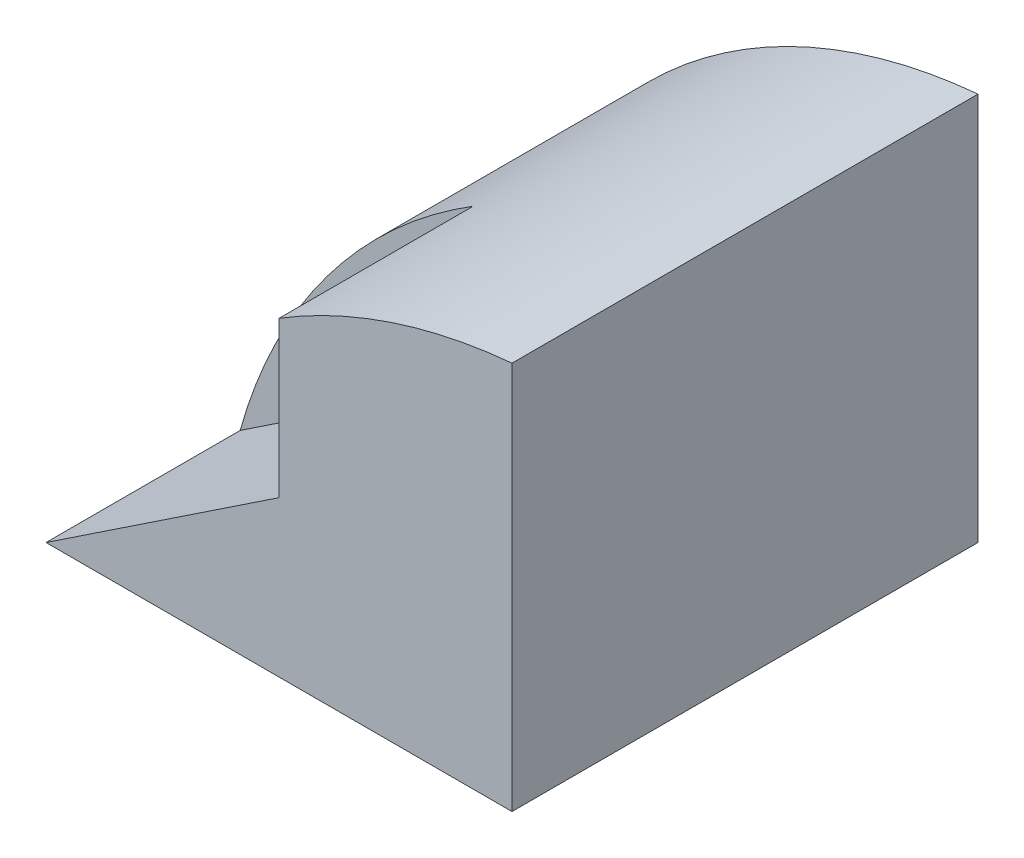
ISO-10303-21;
HEADER;
FILE_DESCRIPTION(('STEP AP214'),'2;1');
FILE_NAME('part.step','',(''),(''),'','','');
FILE_SCHEMA(('AUTOMOTIVE_DESIGN { 1 0 10303 214 1 1 1 1 }'));
ENDSEC;
DATA;
#1=APPLICATION_CONTEXT('core data for automotive mechanical design processes');
#2=APPLICATION_PROTOCOL_DEFINITION('international standard','automotive_design',2000,#1);
#3=PRODUCT_CONTEXT('',#1,'mechanical');
#4=PRODUCT('Part','Part','',(#3));
#5=PRODUCT_RELATED_PRODUCT_CATEGORY('part','',(#4));
#6=PRODUCT_DEFINITION_FORMATION('','',#4);
#7=PRODUCT_DEFINITION_CONTEXT('part definition',#1,'design');
#8=PRODUCT_DEFINITION('design','',#6,#7);
#9=PRODUCT_DEFINITION_SHAPE('','',#8);
#10=(LENGTH_UNIT() NAMED_UNIT(*) SI_UNIT(.MILLI.,.METRE.));
#11=(NAMED_UNIT(*) PLANE_ANGLE_UNIT() SI_UNIT($,.RADIAN.));
#12=(NAMED_UNIT(*) SI_UNIT($,.STERADIAN.) SOLID_ANGLE_UNIT());
#13=UNCERTAINTY_MEASURE_WITH_UNIT(LENGTH_MEASURE(1.E-05),#10,'distance_accuracy_value','');
#14=(GEOMETRIC_REPRESENTATION_CONTEXT(3) GLOBAL_UNCERTAINTY_ASSIGNED_CONTEXT((#13)) GLOBAL_UNIT_ASSIGNED_CONTEXT((#10,
#11,#12)) REPRESENTATION_CONTEXT('',''));
#15=CARTESIAN_POINT('',(0.,0.,0.));
#16=DIRECTION('',(0.,0.,1.));
#17=DIRECTION('',(1.,0.,0.));
#18=AXIS2_PLACEMENT_3D('',#15,#16,#17);
#19=CARTESIAN_POINT('',(-3.,5.,3.));
#20=DIRECTION('',(0.,0.,-1.));
#21=DIRECTION('',(-1.,0.,0.));
#22=AXIS2_PLACEMENT_3D('',#19,#20,#21);
#23=PLANE('',#22);
#24=DIRECTION('',(-0.832050294337844,-0.554700196225229,0.));
#25=VECTOR('',#24,1.);
#26=CARTESIAN_POINT('',(-0.923076923076923,1.38461538461538,3.));
#27=LINE('',#26,#25);
#28=CARTESIAN_POINT('',(0.,2.,3.));
#29=VERTEX_POINT('',#28);
#30=CARTESIAN_POINT('',(-3.,0.,3.));
#31=VERTEX_POINT('',#30);
#32=EDGE_CURVE('E96',#29,#31,#27,.T.);
#33=ORIENTED_EDGE('',*,*,#32,.T.);
#34=DIRECTION('',(1.,0.,0.));
#35=VECTOR('',#34,1.);
#36=CARTESIAN_POINT('',(-3.,0.,3.));
#37=LINE('',#36,#35);
#38=CARTESIAN_POINT('',(3.,0.,3.));
#39=VERTEX_POINT('',#38);
#40=EDGE_CURVE('E56',#31,#39,#37,.T.);
#41=ORIENTED_EDGE('',*,*,#40,.T.);
#42=DIRECTION('',(0.,-1.,0.));
#43=VECTOR('',#42,1.);
#44=CARTESIAN_POINT('',(3.,5.,3.));
#45=LINE('',#44,#43);
#46=CARTESIAN_POINT('',(3.,5.,3.));
#47=VERTEX_POINT('',#46);
#48=EDGE_CURVE('E41',#47,#39,#45,.T.);
#49=ORIENTED_EDGE('',*,*,#48,.F.);
#50=CARTESIAN_POINT('',(3.61111111111111,-1.83333333333333,3.));
#51=DIRECTION('',(0.,0.,1.));
#52=DIRECTION('',(1.,0.,0.));
#53=AXIS2_PLACEMENT_3D('',#50,#51,#52);
#54=CIRCLE('',#53,6.86060501957137);
#55=CARTESIAN_POINT('',(0.,4.,3.));
#56=VERTEX_POINT('',#55);
#57=EDGE_CURVE('E109',#56,#47,#54,.F.);
#58=ORIENTED_EDGE('',*,*,#57,.F.);
#59=DIRECTION('',(0.,-1.,0.));
#60=VECTOR('',#59,1.);
#61=CARTESIAN_POINT('',(0.,0.,3.));
#62=LINE('',#61,#60);
#63=EDGE_CURVE('E101',#56,#29,#62,.T.);
#64=ORIENTED_EDGE('',*,*,#63,.T.);
#65=EDGE_LOOP('',(#33,#41,#49,#58,#64));
#66=FACE_BOUND('',#65,.T.);
#67=ADVANCED_FACE('F33',(#66),#23,.F.);
#68=CARTESIAN_POINT('',(3.61111111111111,-1.83333333333333,-9.5));
#69=DIRECTION('',(0.,0.,1.));
#70=DIRECTION('',(1.,0.,0.));
#71=AXIS2_PLACEMENT_3D('',#68,#69,#70);
#72=CYLINDRICAL_SURFACE('',#71,6.86060501957137);
#73=DIRECTION('',(0.,0.,1.));
#74=VECTOR('',#73,1.);
#75=CARTESIAN_POINT('',(0.,4.,0.5));
#76=LINE('',#75,#74);
#77=CARTESIAN_POINT('',(0.,4.,0.5));
#78=VERTEX_POINT('',#77);
#79=EDGE_CURVE('E89',#78,#56,#76,.T.);
#80=ORIENTED_EDGE('',*,*,#79,.T.);
#81=ORIENTED_EDGE('',*,*,#57,.T.);
#82=DIRECTION('',(0.,0.,-1.));
#83=VECTOR('',#82,1.);
#84=CARTESIAN_POINT('',(3.,5.,3.));
#85=LINE('',#84,#83);
#86=CARTESIAN_POINT('',(3.,5.,-3.));
#87=VERTEX_POINT('',#86);
#88=EDGE_CURVE('E116',#47,#87,#85,.T.);
#89=ORIENTED_EDGE('',*,*,#88,.T.);
#90=CARTESIAN_POINT('',(3.61111111111111,-1.83333333333333,-3.));
#91=DIRECTION('',(0.,0.,1.));
#92=DIRECTION('',(1.,0.,0.));
#93=AXIS2_PLACEMENT_3D('',#90,#91,#92);
#94=CIRCLE('',#93,6.86060501957137);
#95=CARTESIAN_POINT('',(-3.,0.,-3.));
#96=VERTEX_POINT('',#95);
#97=EDGE_CURVE('E112',#96,#87,#94,.F.);
#98=ORIENTED_EDGE('',*,*,#97,.F.);
#99=DIRECTION('',(0.,0.,1.));
#100=VECTOR('',#99,1.);
#101=CARTESIAN_POINT('',(-3.,0.,3.));
#102=LINE('',#101,#100);
#103=CARTESIAN_POINT('',(-3.,0.,0.5));
#104=VERTEX_POINT('',#103);
#105=EDGE_CURVE('E123',#96,#104,#102,.T.);
#106=ORIENTED_EDGE('',*,*,#105,.T.);
#107=CARTESIAN_POINT('',(3.61111111111111,-1.83333333333333,0.5));
#108=DIRECTION('',(0.,0.,1.));
#109=DIRECTION('',(1.,0.,0.));
#110=AXIS2_PLACEMENT_3D('',#107,#108,#109);
#111=CIRCLE('',#110,6.86060501957137);
#112=EDGE_CURVE('E91',#78,#104,#111,.T.);
#113=ORIENTED_EDGE('',*,*,#112,.F.);
#114=EDGE_LOOP('',(#80,#81,#89,#98,#106,#113));
#115=FACE_BOUND('',#114,.T.);
#116=ADVANCED_FACE('F137',(#115),#72,.T.);
#117=CARTESIAN_POINT('',(-3.,5.,-3.));
#118=DIRECTION('',(0.,0.,1.));
#119=DIRECTION('',(1.,0.,0.));
#120=AXIS2_PLACEMENT_3D('',#117,#118,#119);
#121=PLANE('',#120);
#122=DIRECTION('',(-1.,0.,0.));
#123=VECTOR('',#122,1.);
#124=CARTESIAN_POINT('',(-3.,0.,-3.));
#125=LINE('',#124,#123);
#126=CARTESIAN_POINT('',(3.,0.,-3.));
#127=VERTEX_POINT('',#126);
#128=EDGE_CURVE('E120',#127,#96,#125,.T.);
#129=ORIENTED_EDGE('',*,*,#128,.T.);
#130=ORIENTED_EDGE('',*,*,#97,.T.);
#131=DIRECTION('',(0.,-1.,0.));
#132=VECTOR('',#131,1.);
#133=CARTESIAN_POINT('',(3.,5.,-3.));
#134=LINE('',#133,#132);
#135=EDGE_CURVE('E11',#87,#127,#134,.T.);
#136=ORIENTED_EDGE('',*,*,#135,.T.);
#137=EDGE_LOOP('',(#129,#130,#136));
#138=FACE_BOUND('',#137,.T.);
#139=ADVANCED_FACE('F135',(#138),#121,.F.);
#140=CARTESIAN_POINT('',(3.,5.,3.));
#141=DIRECTION('',(-1.,0.,0.));
#142=DIRECTION('',(0.,0.,1.));
#143=AXIS2_PLACEMENT_3D('',#140,#141,#142);
#144=PLANE('',#143);
#145=DIRECTION('',(0.,0.,-1.));
#146=VECTOR('',#145,1.);
#147=CARTESIAN_POINT('',(3.,0.,3.));
#148=LINE('',#147,#146);
#149=EDGE_CURVE('E115',#39,#127,#148,.T.);
#150=ORIENTED_EDGE('',*,*,#149,.T.);
#151=ORIENTED_EDGE('',*,*,#135,.F.);
#152=ORIENTED_EDGE('',*,*,#88,.F.);
#153=ORIENTED_EDGE('',*,*,#48,.T.);
#154=EDGE_LOOP('',(#150,#151,#152,#153));
#155=FACE_BOUND('',#154,.T.);
#156=ADVANCED_FACE('F35',(#155),#144,.F.);
#157=CARTESIAN_POINT('',(0.,0.,0.));
#158=DIRECTION('',(0.,-1.,0.));
#159=DIRECTION('',(0.,0.,-1.));
#160=AXIS2_PLACEMENT_3D('',#157,#158,#159);
#161=PLANE('',#160);
#162=ORIENTED_EDGE('',*,*,#149,.F.);
#163=ORIENTED_EDGE('',*,*,#40,.F.);
#164=DIRECTION('',(0.,0.,1.));
#165=VECTOR('',#164,1.);
#166=CARTESIAN_POINT('',(-3.,0.,0.5));
#167=LINE('',#166,#165);
#168=EDGE_CURVE('E107',#104,#31,#167,.T.);
#169=ORIENTED_EDGE('',*,*,#168,.F.);
#170=ORIENTED_EDGE('',*,*,#105,.F.);
#171=ORIENTED_EDGE('',*,*,#128,.F.);
#172=EDGE_LOOP('',(#162,#163,#169,#170,#171));
#173=FACE_BOUND('',#172,.T.);
#174=ADVANCED_FACE('F132',(#173),#161,.T.);
#175=CARTESIAN_POINT('',(-0.923076923076923,1.38461538461538,0.5));
#176=DIRECTION('',(-0.554700196225229,0.832050294337843,0.));
#177=DIRECTION('',(-0.832050294337844,-0.554700196225229,0.));
#178=AXIS2_PLACEMENT_3D('',#175,#176,#177);
#179=PLANE('',#178);
#180=ORIENTED_EDGE('',*,*,#32,.F.);
#181=DIRECTION('',(0.,0.,1.));
#182=VECTOR('',#181,1.);
#183=CARTESIAN_POINT('',(0.,2.,0.5));
#184=LINE('',#183,#182);
#185=CARTESIAN_POINT('',(0.,2.,0.5));
#186=VERTEX_POINT('',#185);
#187=EDGE_CURVE('E86',#186,#29,#184,.T.);
#188=ORIENTED_EDGE('',*,*,#187,.F.);
#189=DIRECTION('',(-0.832050294337844,-0.554700196225229,0.));
#190=VECTOR('',#189,1.);
#191=CARTESIAN_POINT('',(-0.923076923076923,1.38461538461538,0.5));
#192=LINE('',#191,#190);
#193=EDGE_CURVE('E92',#186,#104,#192,.T.);
#194=ORIENTED_EDGE('',*,*,#193,.T.);
#195=ORIENTED_EDGE('',*,*,#168,.T.);
#196=EDGE_LOOP('',(#180,#188,#194,#195));
#197=FACE_BOUND('',#196,.T.);
#198=ADVANCED_FACE('F95',(#197),#179,.T.);
#199=CARTESIAN_POINT('',(0.,0.,0.5));
#200=DIRECTION('',(-1.,0.,0.));
#201=DIRECTION('',(0.,-1.,0.));
#202=AXIS2_PLACEMENT_3D('',#199,#200,#201);
#203=PLANE('',#202);
#204=ORIENTED_EDGE('',*,*,#63,.F.);
#205=ORIENTED_EDGE('',*,*,#79,.F.);
#206=DIRECTION('',(0.,-1.,0.));
#207=VECTOR('',#206,1.);
#208=CARTESIAN_POINT('',(0.,0.,0.5));
#209=LINE('',#208,#207);
#210=EDGE_CURVE('E48',#78,#186,#209,.T.);
#211=ORIENTED_EDGE('',*,*,#210,.T.);
#212=ORIENTED_EDGE('',*,*,#187,.T.);
#213=EDGE_LOOP('',(#204,#205,#211,#212));
#214=FACE_BOUND('',#213,.T.);
#215=ADVANCED_FACE('F85',(#214),#203,.T.);
#216=CARTESIAN_POINT('',(0.,0.,0.5));
#217=DIRECTION('',(0.,0.,1.));
#218=DIRECTION('',(1.,0.,0.));
#219=AXIS2_PLACEMENT_3D('',#216,#217,#218);
#220=PLANE('',#219);
#221=ORIENTED_EDGE('',*,*,#193,.F.);
#222=ORIENTED_EDGE('',*,*,#210,.F.);
#223=ORIENTED_EDGE('',*,*,#112,.T.);
#224=EDGE_LOOP('',(#221,#222,#223));
#225=FACE_BOUND('',#224,.T.);
#226=ADVANCED_FACE('F99',(#225),#220,.T.);
#227=CLOSED_SHELL('',(#67,#116,#139,#156,#174,#198,#215,#226));
#228=MANIFOLD_SOLID_BREP('B2',#227);
#229=ADVANCED_BREP_SHAPE_REPRESENTATION('',(#18,#228),#14);
#230=SHAPE_DEFINITION_REPRESENTATION(#9,#229);
ENDSEC;
END-ISO-10303-21;
